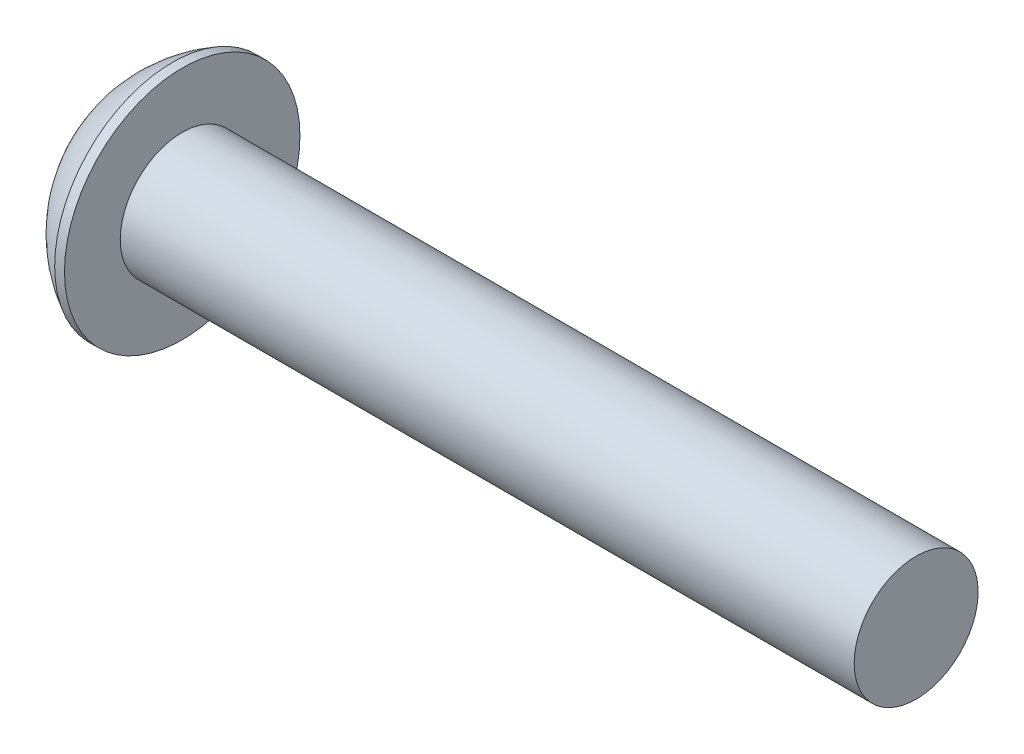
ISO-10303-21;
HEADER;
FILE_DESCRIPTION(('STEP AP214'),'2;1');
FILE_NAME('part.step','',(''),(''),'','','');
FILE_SCHEMA(('AUTOMOTIVE_DESIGN { 1 0 10303 214 1 1 1 1 }'));
ENDSEC;
DATA;
#1=APPLICATION_CONTEXT('core data for automotive mechanical design processes');
#2=APPLICATION_PROTOCOL_DEFINITION('international standard','automotive_design',2000,#1);
#3=PRODUCT_CONTEXT('',#1,'mechanical');
#4=PRODUCT('Part','Part','',(#3));
#5=PRODUCT_RELATED_PRODUCT_CATEGORY('part','',(#4));
#6=PRODUCT_DEFINITION_FORMATION('','',#4);
#7=PRODUCT_DEFINITION_CONTEXT('part definition',#1,'design');
#8=PRODUCT_DEFINITION('design','',#6,#7);
#9=PRODUCT_DEFINITION_SHAPE('','',#8);
#10=(LENGTH_UNIT() NAMED_UNIT(*) SI_UNIT(.MILLI.,.METRE.));
#11=(NAMED_UNIT(*) PLANE_ANGLE_UNIT() SI_UNIT($,.RADIAN.));
#12=(NAMED_UNIT(*) SI_UNIT($,.STERADIAN.) SOLID_ANGLE_UNIT());
#13=UNCERTAINTY_MEASURE_WITH_UNIT(LENGTH_MEASURE(1.E-05),#10,'distance_accuracy_value','');
#14=(GEOMETRIC_REPRESENTATION_CONTEXT(3) GLOBAL_UNCERTAINTY_ASSIGNED_CONTEXT((#13)) GLOBAL_UNIT_ASSIGNED_CONTEXT((#10,
#11,#12)) REPRESENTATION_CONTEXT('',''));
#15=CARTESIAN_POINT('',(0.,0.,0.));
#16=DIRECTION('',(0.,0.,1.));
#17=DIRECTION('',(1.,0.,0.));
#18=AXIS2_PLACEMENT_3D('',#15,#16,#17);
#19=CARTESIAN_POINT('',(-1.82880000000001,0.,0.));
#20=DIRECTION('',(-1.,0.,0.));
#21=DIRECTION('',(0.,0.,1.));
#22=AXIS2_PLACEMENT_3D('',#19,#20,#21);
#23=CONICAL_SURFACE('',#22,1.8288,0.785398163397446);
#24=CARTESIAN_POINT('',(-1.82880000000001,0.,0.));
#25=DIRECTION('',(-1.,0.,0.));
#26=DIRECTION('',(0.,0.,1.));
#27=AXIS2_PLACEMENT_3D('',#24,#25,#26);
#28=CIRCLE('',#27,1.8288);
#29=CARTESIAN_POINT('',(-1.82880000000001,-1.58004822109681,0.920845838894231));
#30=VERTEX_POINT('',#29);
#31=CARTESIAN_POINT('',(-1.82880000000001,-0.00745177890319401,1.82878481812136));
#32=VERTEX_POINT('',#31);
#33=EDGE_CURVE('E240',#30,#32,#28,.T.);
#34=ORIENTED_EDGE('',*,*,#33,.T.);
#35=CARTESIAN_POINT('',(-1.82900000000001,-0.00710296193273345,1.82898620769315));
#36=CARTESIAN_POINT('',(-1.79798176582111,-0.0612413968680546,1.79772936770974));
#37=CARTESIAN_POINT('',(-1.768804762154,-0.116280715119972,1.76595240250098));
#38=CARTESIAN_POINT('',(-1.71541731135211,-0.228486753173012,1.70117021622636));
#39=CARTESIAN_POINT('',(-1.6912359800132,-0.285663770827649,1.66815904969199));
#40=CARTESIAN_POINT('',(-1.64983313923053,-0.400953626097388,1.60159642071718));
#41=CARTESIAN_POINT('',(-1.63250927558265,-0.459038096623036,1.56806133602346));
#42=CARTESIAN_POINT('',(-1.60583796244815,-0.576464657697729,1.50026507937697));
#43=CARTESIAN_POINT('',(-1.59647107247955,-0.635803317985221,1.46600588788664));
#44=CARTESIAN_POINT('',(-1.58800887531627,-0.738427717920976,1.4067556629583));
#45=CARTESIAN_POINT('',(-1.58678086812113,-0.781586520417755,1.38183791671889));
#46=CARTESIAN_POINT('',(-1.58902398395721,-0.867829492194639,1.33204551374779));
#47=CARTESIAN_POINT('',(-1.59249673611106,-0.91091363041643,1.30717087494764));
#48=CARTESIAN_POINT('',(-1.60394206540771,-0.996659819496216,1.25766528960044));
#49=CARTESIAN_POINT('',(-1.61191838302761,-1.0393214894606,1.23303456296242));
#50=CARTESIAN_POINT('',(-1.63193840774461,-1.12392707655171,1.18418750448042));
#51=CARTESIAN_POINT('',(-1.6439838418413,-1.1658706809649,1.15997135318168));
#52=CARTESIAN_POINT('',(-1.67924043571692,-1.27185330769289,1.09878225511086));
#53=CARTESIAN_POINT('',(-1.70494165955475,-1.33527334252756,1.06216668092704));
#54=CARTESIAN_POINT('',(-1.74825503670668,-1.4285641683064,1.00830519755071));
#55=CARTESIAN_POINT('',(-1.76346130507454,-1.45931193774139,0.990552964590433));
#56=CARTESIAN_POINT('',(-1.79524996181871,-1.52025510962339,0.955367407899094));
#57=CARTESIAN_POINT('',(-1.8118317729839,-1.55045073733563,0.937933954111083));
#58=CARTESIAN_POINT('',(-1.82900000000027,-1.58039703806773,0.920644449322171));
#59=B_SPLINE_CURVE_WITH_KNOTS('',3,(#35,#36,#37,#38,#39,#40,#41,#42,#43,#44,#45,#46,#47,#48,#49,
#50,#51,#52,#53,#54,#55,#56,#57,#58),.UNSPECIFIED.,.F.,.F.,(4,2,2,2,2,2,2,2,2,2,2,4),(0.,
0.209500144466995,0.420188843332821,0.627602144749848,0.834507224341982,0.983847288144541,
1.13323912136536,1.28275521623455,1.43233484807212,1.66469982490852,1.78055165650198,
1.89635511741463),.UNSPECIFIED.);
#60=EDGE_CURVE('E210',#32,#30,#59,.T.);
#61=ORIENTED_EDGE('',*,*,#60,.T.);
#62=EDGE_LOOP('',(#34,#61));
#63=FACE_BOUND('',#62,.T.);
#64=ADVANCED_FACE('F37',(#63),#23,.F.);
#65=CARTESIAN_POINT('',(-1.82880000000001,-1.5875,-0.907938979227128));
#66=VERTEX_POINT('',#65);
#67=CARTESIAN_POINT('',(-1.82880000000001,-1.5875,0.907938979227128));
#68=VERTEX_POINT('',#67);
#69=EDGE_CURVE('E271',#66,#68,#28,.T.);
#70=ORIENTED_EDGE('',*,*,#69,.T.);
#71=CARTESIAN_POINT('',(-2.41884583359235,-1.5875,-1.82500929221936));
#72=CARTESIAN_POINT('',(-2.38531276542623,-1.5875,-1.78055818469936));
#73=CARTESIAN_POINT('',(-2.35210936835997,-1.5875,-1.73585907650942));
#74=CARTESIAN_POINT('',(-2.28649794756445,-1.5875,-1.64586427633954));
#75=CARTESIAN_POINT('',(-2.25409012601858,-1.5875,-1.600568437113));
#76=CARTESIAN_POINT('',(-2.15780190494498,-1.5875,-1.46297210215584));
#77=CARTESIAN_POINT('',(-2.09537319757193,-1.5875,-1.36963858857972));
#78=CARTESIAN_POINT('',(-1.97284516161749,-1.5875,-1.1739408617932));
#79=CARTESIAN_POINT('',(-1.91308014332863,-1.5875,-1.07136492019386));
#80=CARTESIAN_POINT('',(-1.80377603992626,-1.5875,-0.861093370178888));
#81=CARTESIAN_POINT('',(-1.75420248563308,-1.5875,-0.753416586787839));
#82=CARTESIAN_POINT('',(-1.69355473541147,-1.5875,-0.59176442890705));
#83=CARTESIAN_POINT('',(-1.67614346878425,-1.5875,-0.540176081947481));
#84=CARTESIAN_POINT('',(-1.64546298974417,-1.5875,-0.435756532214797));
#85=CARTESIAN_POINT('',(-1.63219406350996,-1.5875,-0.382925243842576));
#86=CARTESIAN_POINT('',(-1.61070764570342,-1.5875,-0.277216790300937));
#87=CARTESIAN_POINT('',(-1.60240378593419,-1.5875,-0.224357458354004));
#88=CARTESIAN_POINT('',(-1.59100915058537,-1.5875,-0.118076745851791));
#89=CARTESIAN_POINT('',(-1.58791748493136,-1.5875,-0.0646554628277626));
#90=CARTESIAN_POINT('',(-1.58717534074502,-1.5875,0.0403024254508756));
#91=CARTESIAN_POINT('',(-1.58933324549264,-1.5875,0.091837742427017));
#92=CARTESIAN_POINT('',(-1.59854919060368,-1.5875,0.194465290551352));
#93=CARTESIAN_POINT('',(-1.60560770796995,-1.5875,0.245557478077194));
#94=CARTESIAN_POINT('',(-1.62435975757509,-1.5875,0.347793759019247));
#95=CARTESIAN_POINT('',(-1.63613206364932,-1.5875,0.398923183857681));
#96=CARTESIAN_POINT('',(-1.66368690090293,-1.5875,0.500065247928145));
#97=CARTESIAN_POINT('',(-1.67946909288466,-1.5875,0.55007798123241));
#98=CARTESIAN_POINT('',(-1.73513369416259,-1.5875,0.707672888264433));
#99=CARTESIAN_POINT('',(-1.78136125535134,-1.5875,0.813008430509164));
#100=CARTESIAN_POINT('',(-1.88413869504212,-1.5875,1.01872985181378));
#101=CARTESIAN_POINT('',(-1.94072568595621,-1.5875,1.11909623158762));
#102=CARTESIAN_POINT('',(-2.05746539148359,-1.5875,1.31090882483437));
#103=CARTESIAN_POINT('',(-2.11730100937777,-1.5875,1.40255044446812));
#104=CARTESIAN_POINT('',(-2.20979890181475,-1.5875,1.53756602680818));
#105=CARTESIAN_POINT('',(-2.24095734379018,-1.5875,1.58198845986807));
#106=CARTESIAN_POINT('',(-2.30409778175578,-1.5875,1.67022633905771));
#107=CARTESIAN_POINT('',(-2.33607954894282,-1.5875,1.71404194872823));
#108=CARTESIAN_POINT('',(-2.36840270150048,-1.5875,1.75760493469799));
#109=B_SPLINE_CURVE_WITH_KNOTS('',3,(#71,#72,#73,#74,#75,#76,#77,#78,#79,#80,#81,#82,#83,#84,
#85,#86,#87,#88,#89,#90,#91,#92,#93,#94,#95,#96,#97,#98,#99,#100,#101,#102,#103,#104,#105,#106,
#107,#108),.UNSPECIFIED.,.F.,.F.,(4,2,2,2,2,2,2,2,2,2,2,2,2,2,2,2,2,2,4),(0.,0.167038582206584,
0.33411918424497,0.670830460170841,1.0266880706705,1.38132155981881,1.54452529826255,
1.70774030934245,1.86802667313751,2.02828566242478,2.18278328824718,2.33729595425851,
2.49450635071892,2.65170345312208,2.99578906555957,3.34113237629954,3.66930816833921,
3.83208342752259,3.99481392942941),.UNSPECIFIED.);
#110=EDGE_CURVE('E219',#68,#66,#109,.F.);
#111=ORIENTED_EDGE('',*,*,#110,.T.);
#112=EDGE_LOOP('',(#70,#111));
#113=FACE_BOUND('',#112,.T.);
#114=ADVANCED_FACE('F291',(#113),#23,.F.);
#115=CARTESIAN_POINT('',(-1.82880000000001,-0.00745177890319544,-1.82878481812136));
#116=VERTEX_POINT('',#115);
#117=CARTESIAN_POINT('',(-1.82880000000001,-1.5800482210968,-0.920845838894231));
#118=VERTEX_POINT('',#117);
#119=EDGE_CURVE('E263',#116,#118,#28,.T.);
#120=ORIENTED_EDGE('',*,*,#119,.T.);
#121=CARTESIAN_POINT('',(-1.82900000000027,-1.58039703806773,-0.92064444932217));
#122=CARTESIAN_POINT('',(-1.79798176582135,-1.52625860313238,-0.951901289305598));
#123=CARTESIAN_POINT('',(-1.76880476215421,-1.47121928488044,-0.983678254514372));
#124=CARTESIAN_POINT('',(-1.71541731135227,-1.35901324682734,-1.04846044078903));
#125=CARTESIAN_POINT('',(-1.69123598001333,-1.30183622917267,-1.08147160732341));
#126=CARTESIAN_POINT('',(-1.64983313923061,-1.18654637390287,-1.14803423629826));
#127=CARTESIAN_POINT('',(-1.63250927558271,-1.12846190337719,-1.181569320992));
#128=CARTESIAN_POINT('',(-1.60583796244818,-1.01103534230243,-1.24936557763853));
#129=CARTESIAN_POINT('',(-1.59647107247956,-0.951696682014903,-1.28362476912888));
#130=CARTESIAN_POINT('',(-1.58800887531627,-0.849072282079112,-1.34287499405724));
#131=CARTESIAN_POINT('',(-1.58678086812113,-0.805913479582333,-1.36779274029665));
#132=CARTESIAN_POINT('',(-1.58902398395721,-0.719670507805445,-1.41758514326775));
#133=CARTESIAN_POINT('',(-1.59249673611105,-0.676586369583652,-1.44245978206791));
#134=CARTESIAN_POINT('',(-1.6039420654077,-0.590840180503863,-1.49196536741511));
#135=CARTESIAN_POINT('',(-1.6119183830276,-0.548178510539482,-1.51659609405312));
#136=CARTESIAN_POINT('',(-1.63193840774459,-0.463572923448364,-1.56544315253513));
#137=CARTESIAN_POINT('',(-1.64398384184128,-0.42162931903517,-1.58965930383387));
#138=CARTESIAN_POINT('',(-1.67924043571687,-0.315646692307252,-1.65084840190465));
#139=CARTESIAN_POINT('',(-1.70494165955467,-0.252226657472646,-1.68746397608843));
#140=CARTESIAN_POINT('',(-1.74825503670654,-0.158935831693912,-1.7413254594647));
#141=CARTESIAN_POINT('',(-1.76346130507437,-0.128188062258946,-1.75907769242496));
#142=CARTESIAN_POINT('',(-1.79524996181849,-0.0672448903770135,-1.79426324911627));
#143=CARTESIAN_POINT('',(-1.81183177298366,-0.0370492626648058,-1.81169670290426));
#144=CARTESIAN_POINT('',(-1.82900000000001,-0.00710296193273376,-1.82898620769315));
#145=B_SPLINE_CURVE_WITH_KNOTS('',3,(#121,#122,#123,#124,#125,#126,#127,#128,#129,#130,#131,
#132,#133,#134,#135,#136,#137,#138,#139,#140,#141,#142,#143,#144),.UNSPECIFIED.,.F.,.F.,(4,2,2,
2,2,2,2,2,2,2,2,4),(0.,0.209500144467117,0.420188843333067,0.627602144750218,0.834507224342474,
0.983847288145038,1.13323912136587,1.28275521623506,1.43233484807263,1.66469982490878,
1.78055165650211,1.89635511741463),.UNSPECIFIED.);
#146=EDGE_CURVE('E269',#118,#116,#145,.T.);
#147=ORIENTED_EDGE('',*,*,#146,.T.);
#148=EDGE_LOOP('',(#120,#147));
#149=FACE_BOUND('',#148,.T.);
#150=ADVANCED_FACE('F268',(#149),#23,.F.);
#151=CARTESIAN_POINT('',(-1.82880000000001,1.5800482210968,-0.920845838894232));
#152=VERTEX_POINT('',#151);
#153=CARTESIAN_POINT('',(-1.82880000000001,0.00745177890319596,-1.82878481812136));
#154=VERTEX_POINT('',#153);
#155=EDGE_CURVE('E270',#152,#154,#28,.T.);
#156=ORIENTED_EDGE('',*,*,#155,.T.);
#157=CARTESIAN_POINT('',(-1.82900000000001,0.00710296193273401,-1.82898620769315));
#158=CARTESIAN_POINT('',(-1.79798176582111,0.0612413968680552,-1.79772936770974));
#159=CARTESIAN_POINT('',(-1.768804762154,0.116280715119972,-1.76595240250098));
#160=CARTESIAN_POINT('',(-1.71541731135211,0.228486753173013,-1.70117021622636));
#161=CARTESIAN_POINT('',(-1.6912359800132,0.28566377082765,-1.66815904969199));
#162=CARTESIAN_POINT('',(-1.64983313923053,0.40095362609739,-1.60159642071718));
#163=CARTESIAN_POINT('',(-1.63250927558265,0.459038096623037,-1.56806133602346));
#164=CARTESIAN_POINT('',(-1.60583796244815,0.57646465769773,-1.50026507937697));
#165=CARTESIAN_POINT('',(-1.59647107247955,0.635803317985223,-1.46600588788664));
#166=CARTESIAN_POINT('',(-1.58800887531627,0.738427717920978,-1.4067556629583));
#167=CARTESIAN_POINT('',(-1.58678086812113,0.781586520417756,-1.38183791671889));
#168=CARTESIAN_POINT('',(-1.58902398395721,0.86782949219464,-1.33204551374779));
#169=CARTESIAN_POINT('',(-1.59249673611106,0.910913630416431,-1.30717087494764));
#170=CARTESIAN_POINT('',(-1.60394206540771,0.996659819496218,-1.25766528960044));
#171=CARTESIAN_POINT('',(-1.61191838302761,1.0393214894606,-1.23303456296242));
#172=CARTESIAN_POINT('',(-1.63193840774461,1.12392707655171,-1.18418750448042));
#173=CARTESIAN_POINT('',(-1.6439838418413,1.1658706809649,-1.15997135318168));
#174=CARTESIAN_POINT('',(-1.67924043571692,1.27185330769289,-1.09878225511085));
#175=CARTESIAN_POINT('',(-1.70494165955476,1.33527334252757,-1.06216668092704));
#176=CARTESIAN_POINT('',(-1.74825503670668,1.4285641683064,-1.00830519755071));
#177=CARTESIAN_POINT('',(-1.76346130507454,1.45931193774139,-0.990552964590433));
#178=CARTESIAN_POINT('',(-1.79524996181871,1.52025510962339,-0.955367407899094));
#179=CARTESIAN_POINT('',(-1.8118317729839,1.55045073733563,-0.937933954111083));
#180=CARTESIAN_POINT('',(-1.82900000000027,1.58039703806773,-0.920644449322171));
#181=B_SPLINE_CURVE_WITH_KNOTS('',3,(#157,#158,#159,#160,#161,#162,#163,#164,#165,#166,#167,
#168,#169,#170,#171,#172,#173,#174,#175,#176,#177,#178,#179,#180),.UNSPECIFIED.,.F.,.F.,(4,2,2,
2,2,2,2,2,2,2,2,4),(0.,0.209500144466995,0.420188843332822,0.627602144749849,0.834507224341983,
0.983847288144542,1.13323912136536,1.28275521623455,1.43233484807213,1.66469982490853,
1.78055165650198,1.89635511741463),.UNSPECIFIED.);
#182=EDGE_CURVE('E306',#154,#152,#181,.T.);
#183=ORIENTED_EDGE('',*,*,#182,.T.);
#184=EDGE_LOOP('',(#156,#183));
#185=FACE_BOUND('',#184,.T.);
#186=ADVANCED_FACE('F288',(#185),#23,.F.);
#187=CARTESIAN_POINT('',(-1.82880000000001,1.5875,0.907938979227128));
#188=VERTEX_POINT('',#187);
#189=CARTESIAN_POINT('',(-1.82880000000001,1.5875,-0.907938979227127));
#190=VERTEX_POINT('',#189);
#191=EDGE_CURVE('E244',#188,#190,#28,.T.);
#192=ORIENTED_EDGE('',*,*,#191,.T.);
#193=CARTESIAN_POINT('',(-2.41884583359235,1.5875,-1.82500929221937));
#194=CARTESIAN_POINT('',(-2.38531276542623,1.5875,-1.78055818469936));
#195=CARTESIAN_POINT('',(-2.35210936835997,1.5875,-1.73585907650943));
#196=CARTESIAN_POINT('',(-2.28649794756445,1.5875,-1.64586427633954));
#197=CARTESIAN_POINT('',(-2.25409012601858,1.5875,-1.600568437113));
#198=CARTESIAN_POINT('',(-2.15780190494498,1.5875,-1.46297210215584));
#199=CARTESIAN_POINT('',(-2.09537319757193,1.5875,-1.36963858857972));
#200=CARTESIAN_POINT('',(-1.97284516161749,1.5875,-1.1739408617932));
#201=CARTESIAN_POINT('',(-1.91308014332863,1.5875,-1.07136492019386));
#202=CARTESIAN_POINT('',(-1.80377603992627,1.5875,-0.86109337017889));
#203=CARTESIAN_POINT('',(-1.75420248563308,1.5875,-0.75341658678784));
#204=CARTESIAN_POINT('',(-1.69355473541147,1.5875,-0.591764428907051));
#205=CARTESIAN_POINT('',(-1.67614346878425,1.5875,-0.540176081947481));
#206=CARTESIAN_POINT('',(-1.64546298974417,1.5875,-0.435756532214797));
#207=CARTESIAN_POINT('',(-1.63219406350996,1.5875,-0.382925243842576));
#208=CARTESIAN_POINT('',(-1.61070764570342,1.5875,-0.277216790300937));
#209=CARTESIAN_POINT('',(-1.60240378593419,1.5875,-0.224357458354004));
#210=CARTESIAN_POINT('',(-1.59100915058537,1.5875,-0.118076745851792));
#211=CARTESIAN_POINT('',(-1.58791748493136,1.5875,-0.0646554628277632));
#212=CARTESIAN_POINT('',(-1.58717534074502,1.5875,0.0403024254508752));
#213=CARTESIAN_POINT('',(-1.58933324549264,1.5875,0.0918377424270167));
#214=CARTESIAN_POINT('',(-1.59854919060368,1.5875,0.194465290551352));
#215=CARTESIAN_POINT('',(-1.60560770796995,1.5875,0.245557478077193));
#216=CARTESIAN_POINT('',(-1.62435975757509,1.5875,0.347793759019247));
#217=CARTESIAN_POINT('',(-1.63613206364932,1.5875,0.39892318385768));
#218=CARTESIAN_POINT('',(-1.66368690090293,1.5875,0.500065247928144));
#219=CARTESIAN_POINT('',(-1.67946909288466,1.5875,0.55007798123241));
#220=CARTESIAN_POINT('',(-1.73513369416259,1.5875,0.707672888264433));
#221=CARTESIAN_POINT('',(-1.78136125535134,1.5875,0.813008430509163));
#222=CARTESIAN_POINT('',(-1.88413869504212,1.5875,1.01872985181378));
#223=CARTESIAN_POINT('',(-1.94072568595621,1.5875,1.11909623158762));
#224=CARTESIAN_POINT('',(-2.05746539148359,1.5875,1.31090882483437));
#225=CARTESIAN_POINT('',(-2.11730100937777,1.5875,1.40255044446812));
#226=CARTESIAN_POINT('',(-2.20979890181475,1.5875,1.53756602680818));
#227=CARTESIAN_POINT('',(-2.24095734379018,1.5875,1.58198845986807));
#228=CARTESIAN_POINT('',(-2.30409778175578,1.5875,1.67022633905771));
#229=CARTESIAN_POINT('',(-2.33607954894282,1.5875,1.71404194872823));
#230=CARTESIAN_POINT('',(-2.36840270150048,1.5875,1.75760493469799));
#231=B_SPLINE_CURVE_WITH_KNOTS('',3,(#193,#194,#195,#196,#197,#198,#199,#200,#201,#202,#203,
#204,#205,#206,#207,#208,#209,#210,#211,#212,#213,#214,#215,#216,#217,#218,#219,#220,#221,#222,
#223,#224,#225,#226,#227,#228,#229,#230),.UNSPECIFIED.,.F.,.F.,(4,2,2,2,2,2,2,2,2,2,2,2,2,2,2,2,
2,2,4),(0.,0.167038582206583,0.334119184244971,0.670830460170842,1.0266880706705,
1.38132155981881,1.54452529826255,1.70774030934245,1.86802667313751,2.02828566242479,
2.18278328824719,2.33729595425851,2.49450635071892,2.65170345312209,2.99578906555957,
3.34113237629954,3.66930816833921,3.83208342752259,3.99481392942941),.UNSPECIFIED.);
#232=EDGE_CURVE('E190',#190,#188,#231,.T.);
#233=ORIENTED_EDGE('',*,*,#232,.T.);
#234=EDGE_LOOP('',(#192,#233));
#235=FACE_BOUND('',#234,.T.);
#236=ADVANCED_FACE('F282',(#235),#23,.F.);
#237=CARTESIAN_POINT('',(-1.82880000000001,0.00745177890319537,1.82878481812136));
#238=VERTEX_POINT('',#237);
#239=CARTESIAN_POINT('',(-1.82880000000001,1.58004822109681,0.920845838894231));
#240=VERTEX_POINT('',#239);
#241=EDGE_CURVE('E241',#238,#240,#28,.T.);
#242=ORIENTED_EDGE('',*,*,#241,.T.);
#243=CARTESIAN_POINT('',(-1.82900000000027,1.58039703806773,0.92064444932217));
#244=CARTESIAN_POINT('',(-1.79798176582135,1.52625860313238,0.951901289305598));
#245=CARTESIAN_POINT('',(-1.76880476215421,1.47121928488044,0.983678254514371));
#246=CARTESIAN_POINT('',(-1.71541731135227,1.35901324682734,1.04846044078903));
#247=CARTESIAN_POINT('',(-1.69123598001333,1.30183622917267,1.08147160732341));
#248=CARTESIAN_POINT('',(-1.64983313923061,1.18654637390287,1.14803423629826));
#249=CARTESIAN_POINT('',(-1.63250927558271,1.12846190337719,1.181569320992));
#250=CARTESIAN_POINT('',(-1.60583796244818,1.01103534230243,1.24936557763853));
#251=CARTESIAN_POINT('',(-1.59647107247956,0.951696682014904,1.28362476912888));
#252=CARTESIAN_POINT('',(-1.58800887531627,0.849072282079113,1.34287499405724));
#253=CARTESIAN_POINT('',(-1.58678086812113,0.805913479582333,1.36779274029665));
#254=CARTESIAN_POINT('',(-1.58902398395721,0.719670507805446,1.41758514326775));
#255=CARTESIAN_POINT('',(-1.59249673611105,0.676586369583653,1.44245978206791));
#256=CARTESIAN_POINT('',(-1.6039420654077,0.590840180503864,1.49196536741511));
#257=CARTESIAN_POINT('',(-1.6119183830276,0.548178510539483,1.51659609405312));
#258=CARTESIAN_POINT('',(-1.63193840774459,0.463572923448365,1.56544315253513));
#259=CARTESIAN_POINT('',(-1.64398384184128,0.421629319035171,1.58965930383387));
#260=CARTESIAN_POINT('',(-1.67924043571687,0.315646692307252,1.65084840190465));
#261=CARTESIAN_POINT('',(-1.70494165955467,0.252226657472647,1.68746397608843));
#262=CARTESIAN_POINT('',(-1.74825503670654,0.158935831693913,1.7413254594647));
#263=CARTESIAN_POINT('',(-1.76346130507437,0.128188062258947,1.75907769242496));
#264=CARTESIAN_POINT('',(-1.79524996181849,0.0672448903770139,1.79426324911627));
#265=CARTESIAN_POINT('',(-1.81183177298366,0.0370492626648061,1.81169670290426));
#266=CARTESIAN_POINT('',(-1.82900000000001,0.00710296193273415,1.82898620769315));
#267=B_SPLINE_CURVE_WITH_KNOTS('',3,(#243,#244,#245,#246,#247,#248,#249,#250,#251,#252,#253,
#254,#255,#256,#257,#258,#259,#260,#261,#262,#263,#264,#265,#266),.UNSPECIFIED.,.F.,.F.,(4,2,2,
2,2,2,2,2,2,2,2,4),(0.,0.209500144467116,0.420188843333066,0.627602144750218,0.834507224342473,
0.983847288145037,1.13323912136587,1.28275521623506,1.43233484807263,1.66469982490878,
1.78055165650211,1.89635511741463),.UNSPECIFIED.);
#268=EDGE_CURVE('E172',#240,#238,#267,.T.);
#269=ORIENTED_EDGE('',*,*,#268,.T.);
#270=EDGE_LOOP('',(#242,#269));
#271=FACE_BOUND('',#270,.T.);
#272=ADVANCED_FACE('F39',(#271),#23,.F.);
#273=CARTESIAN_POINT('',(-1.82880000000001,2.413,0.));
#274=DIRECTION('',(1.,0.,0.));
#275=DIRECTION('',(0.,0.,-1.));
#276=AXIS2_PLACEMENT_3D('',#273,#274,#275);
#277=PLANE('',#276);
#278=ORIENTED_EDGE('',*,*,#33,.F.);
#279=DIRECTION('',(0.,0.866025403784439,0.5));
#280=VECTOR('',#279,1.);
#281=CARTESIAN_POINT('',(-1.82880000000001,-1.5875,0.91654355233853));
#282=LINE('',#281,#280);
#283=CARTESIAN_POINT('',(-1.82880000000001,-1.5875,0.91654355233853));
#284=VERTEX_POINT('',#283);
#285=EDGE_CURVE('E161',#284,#30,#282,.T.);
#286=ORIENTED_EDGE('',*,*,#285,.F.);
#287=DIRECTION('',(0.,0.,-1.));
#288=VECTOR('',#287,1.);
#289=CARTESIAN_POINT('',(-1.82880000000001,-1.5875,0.));
#290=LINE('',#289,#288);
#291=EDGE_CURVE('E11',#284,#68,#290,.T.);
#292=ORIENTED_EDGE('',*,*,#291,.T.);
#293=ORIENTED_EDGE('',*,*,#69,.F.);
#294=DIRECTION('',(0.,0.,1.));
#295=VECTOR('',#294,1.);
#296=CARTESIAN_POINT('',(-1.82880000000001,-1.5875,-0.91654355233853));
#297=LINE('',#296,#295);
#298=CARTESIAN_POINT('',(-1.82880000000001,-1.5875,-0.91654355233853));
#299=VERTEX_POINT('',#298);
#300=EDGE_CURVE('E149',#299,#66,#297,.T.);
#301=ORIENTED_EDGE('',*,*,#300,.F.);
#302=DIRECTION('',(0.,0.866025403784439,-0.5));
#303=VECTOR('',#302,1.);
#304=CARTESIAN_POINT('',(-1.82880000000001,1.016,-2.41967497817372));
#305=LINE('',#304,#303);
#306=EDGE_CURVE('E46',#299,#118,#305,.T.);
#307=ORIENTED_EDGE('',*,*,#306,.T.);
#308=ORIENTED_EDGE('',*,*,#119,.F.);
#309=DIRECTION('',(0.,-0.866025403784438,0.5));
#310=VECTOR('',#309,1.);
#311=CARTESIAN_POINT('',(-1.82880000000001,0.,-1.83308710467706));
#312=LINE('',#311,#310);
#313=CARTESIAN_POINT('',(-1.82880000000001,0.,-1.83308710467706));
#314=VERTEX_POINT('',#313);
#315=EDGE_CURVE('E151',#314,#116,#312,.T.);
#316=ORIENTED_EDGE('',*,*,#315,.F.);
#317=DIRECTION('',(0.,0.866025403784439,0.5));
#318=VECTOR('',#317,1.);
#319=CARTESIAN_POINT('',(-1.82880000000001,2.6035,-0.329955678841872));
#320=LINE('',#319,#318);
#321=EDGE_CURVE('E252',#314,#154,#320,.T.);
#322=ORIENTED_EDGE('',*,*,#321,.T.);
#323=ORIENTED_EDGE('',*,*,#155,.F.);
#324=DIRECTION('',(0.,-0.866025403784438,-0.5));
#325=VECTOR('',#324,1.);
#326=CARTESIAN_POINT('',(-1.82880000000001,1.5875,-0.91654355233853));
#327=LINE('',#326,#325);
#328=CARTESIAN_POINT('',(-1.82880000000001,1.5875,-0.91654355233853));
#329=VERTEX_POINT('',#328);
#330=EDGE_CURVE('E167',#329,#152,#327,.T.);
#331=ORIENTED_EDGE('',*,*,#330,.F.);
#332=DIRECTION('',(0.,0.,1.));
#333=VECTOR('',#332,1.);
#334=CARTESIAN_POINT('',(-1.82880000000001,1.5875,0.));
#335=LINE('',#334,#333);
#336=EDGE_CURVE('E248',#329,#190,#335,.T.);
#337=ORIENTED_EDGE('',*,*,#336,.T.);
#338=ORIENTED_EDGE('',*,*,#191,.F.);
#339=DIRECTION('',(0.,0.,-1.));
#340=VECTOR('',#339,1.);
#341=CARTESIAN_POINT('',(-1.82880000000001,1.5875,0.91654355233853));
#342=LINE('',#341,#340);
#343=CARTESIAN_POINT('',(-1.82880000000001,1.5875,0.91654355233853));
#344=VERTEX_POINT('',#343);
#345=EDGE_CURVE('E165',#344,#188,#342,.T.);
#346=ORIENTED_EDGE('',*,*,#345,.F.);
#347=DIRECTION('',(0.,-0.866025403784438,0.5));
#348=VECTOR('',#347,1.);
#349=CARTESIAN_POINT('',(-1.82880000000001,2.6035,0.329955678841871));
#350=LINE('',#349,#348);
#351=EDGE_CURVE('E245',#344,#240,#350,.T.);
#352=ORIENTED_EDGE('',*,*,#351,.T.);
#353=ORIENTED_EDGE('',*,*,#241,.F.);
#354=DIRECTION('',(0.,0.866025403784438,-0.5));
#355=VECTOR('',#354,1.);
#356=CARTESIAN_POINT('',(-1.82880000000001,0.,1.83308710467706));
#357=LINE('',#356,#355);
#358=CARTESIAN_POINT('',(-1.82880000000001,0.,1.83308710467706));
#359=VERTEX_POINT('',#358);
#360=EDGE_CURVE('E163',#359,#238,#357,.T.);
#361=ORIENTED_EDGE('',*,*,#360,.F.);
#362=DIRECTION('',(0.,-0.866025403784439,-0.5));
#363=VECTOR('',#362,1.);
#364=CARTESIAN_POINT('',(-1.82880000000001,1.016,2.41967497817372));
#365=LINE('',#364,#363);
#366=EDGE_CURVE('E132',#359,#32,#365,.T.);
#367=ORIENTED_EDGE('',*,*,#366,.T.);
#368=EDGE_LOOP('',(#278,#286,#292,#293,#301,#307,#308,#316,#322,#323,#331,#337,#338,#346,#352,
#353,#361,#367));
#369=FACE_BOUND('',#368,.T.);
#370=CARTESIAN_POINT('',(-1.82880000000001,0.,0.));
#371=DIRECTION('',(-1.,0.,0.));
#372=DIRECTION('',(0.,0.,1.));
#373=AXIS2_PLACEMENT_3D('',#370,#371,#372);
#374=CIRCLE('',#373,2.413);
#375=CARTESIAN_POINT('',(-1.82880000000001,0.,2.413));
#376=VERTEX_POINT('',#375);
#377=EDGE_CURVE('E237',#376,#376,#374,.T.);
#378=ORIENTED_EDGE('',*,*,#377,.T.);
#379=EDGE_LOOP('',(#378));
#380=FACE_BOUND('',#379,.T.);
#381=ADVANCED_FACE('F260',(#369,#380),#277,.F.);
#382=CARTESIAN_POINT('',(2.75154317616325,0.,0.));
#383=DIRECTION('',(-1.,0.,0.));
#384=DIRECTION('',(0.,0.,1.));
#385=AXIS2_PLACEMENT_3D('',#382,#383,#384);
#386=DEGENERATE_TOROIDAL_SURFACE('',#385,0.00969167426947842,5.1816,.F.);
#387=ORIENTED_EDGE('',*,*,#377,.F.);
#388=EDGE_LOOP('',(#387));
#389=FACE_BOUND('',#388,.T.);
#390=CARTESIAN_POINT('',(0.355599999999993,0.,0.));
#391=DIRECTION('',(-1.,0.,0.));
#392=DIRECTION('',(0.,0.,1.));
#393=AXIS2_PLACEMENT_3D('',#390,#391,#392);
#394=CIRCLE('',#393,4.5847);
#395=CARTESIAN_POINT('',(0.355599999999993,0.,4.5847));
#396=VERTEX_POINT('',#395);
#397=EDGE_CURVE('E234',#396,#396,#394,.T.);
#398=ORIENTED_EDGE('',*,*,#397,.T.);
#399=EDGE_LOOP('',(#398));
#400=FACE_BOUND('',#399,.T.);
#401=ADVANCED_FACE('F287',(#389,#400),#386,.F.);
#402=CARTESIAN_POINT('',(0.,0.,0.));
#403=DIRECTION('',(-1.,0.,0.));
#404=DIRECTION('',(0.,0.,1.));
#405=AXIS2_PLACEMENT_3D('',#402,#403,#404);
#406=CYLINDRICAL_SURFACE('',#405,4.5847);
#407=ORIENTED_EDGE('',*,*,#397,.F.);
#408=EDGE_LOOP('',(#407));
#409=FACE_BOUND('',#408,.T.);
#410=CARTESIAN_POINT('',(0.736599999999993,0.,0.));
#411=DIRECTION('',(-1.,0.,0.));
#412=DIRECTION('',(0.,0.,1.));
#413=AXIS2_PLACEMENT_3D('',#410,#411,#412);
#414=CIRCLE('',#413,4.5847);
#415=CARTESIAN_POINT('',(0.736599999999993,0.,4.5847));
#416=VERTEX_POINT('',#415);
#417=EDGE_CURVE('E231',#416,#416,#414,.T.);
#418=ORIENTED_EDGE('',*,*,#417,.T.);
#419=EDGE_LOOP('',(#418));
#420=FACE_BOUND('',#419,.T.);
#421=ADVANCED_FACE('F385',(#409,#420),#406,.T.);
#422=CARTESIAN_POINT('',(0.736599999999993,2.413,0.));
#423=DIRECTION('',(-1.,0.,0.));
#424=DIRECTION('',(0.,0.,1.));
#425=AXIS2_PLACEMENT_3D('',#422,#423,#424);
#426=PLANE('',#425);
#427=ORIENTED_EDGE('',*,*,#417,.F.);
#428=EDGE_LOOP('',(#427));
#429=FACE_BOUND('',#428,.T.);
#430=CARTESIAN_POINT('',(0.736599999999993,0.,0.));
#431=DIRECTION('',(-1.,0.,0.));
#432=DIRECTION('',(0.,0.,1.));
#433=AXIS2_PLACEMENT_3D('',#430,#431,#432);
#434=CIRCLE('',#433,2.413);
#435=CARTESIAN_POINT('',(0.736599999999993,0.,2.413));
#436=VERTEX_POINT('',#435);
#437=EDGE_CURVE('E228',#436,#436,#434,.T.);
#438=ORIENTED_EDGE('',*,*,#437,.T.);
#439=EDGE_LOOP('',(#438));
#440=FACE_BOUND('',#439,.T.);
#441=ADVANCED_FACE('F378',(#429,#440),#426,.F.);
#442=CARTESIAN_POINT('',(0.,0.,0.));
#443=DIRECTION('',(-1.,0.,0.));
#444=DIRECTION('',(0.,0.,1.));
#445=AXIS2_PLACEMENT_3D('',#442,#443,#444);
#446=CYLINDRICAL_SURFACE('',#445,2.413);
#447=ORIENTED_EDGE('',*,*,#437,.F.);
#448=EDGE_LOOP('',(#447));
#449=FACE_BOUND('',#448,.T.);
#450=CARTESIAN_POINT('',(29.3116,0.,0.));
#451=DIRECTION('',(-1.,0.,0.));
#452=DIRECTION('',(0.,0.,1.));
#453=AXIS2_PLACEMENT_3D('',#450,#451,#452);
#454=CIRCLE('',#453,2.413);
#455=CARTESIAN_POINT('',(29.3116,0.,2.413));
#456=VERTEX_POINT('',#455);
#457=EDGE_CURVE('E218',#456,#456,#454,.T.);
#458=ORIENTED_EDGE('',*,*,#457,.T.);
#459=EDGE_LOOP('',(#458));
#460=FACE_BOUND('',#459,.T.);
#461=ADVANCED_FACE('F370',(#449,#460),#446,.T.);
#462=CARTESIAN_POINT('',(29.3116,0.,0.));
#463=DIRECTION('',(-1.,0.,0.));
#464=DIRECTION('',(0.,0.,1.));
#465=AXIS2_PLACEMENT_3D('',#462,#463,#464);
#466=PLANE('',#465);
#467=ORIENTED_EDGE('',*,*,#457,.F.);
#468=EDGE_LOOP('',(#467));
#469=FACE_BOUND('',#468,.T.);
#470=ADVANCED_FACE('F207',(#469),#466,.F.);
#471=CARTESIAN_POINT('',(0.,-1.5875,0.91654355233853));
#472=DIRECTION('',(0.,-0.5,0.866025403784439));
#473=DIRECTION('',(0.,-0.866025403784439,-0.5));
#474=AXIS2_PLACEMENT_3D('',#471,#472,#473);
#475=PLANE('',#474);
#476=ORIENTED_EDGE('',*,*,#366,.F.);
#477=DIRECTION('',(-1.,0.,0.));
#478=VECTOR('',#477,1.);
#479=CARTESIAN_POINT('',(0.,0.,1.83308710467706));
#480=LINE('',#479,#478);
#481=CARTESIAN_POINT('',(0.,0.,1.83308710467706));
#482=VERTEX_POINT('',#481);
#483=EDGE_CURVE('E53',#482,#359,#480,.T.);
#484=ORIENTED_EDGE('',*,*,#483,.F.);
#485=DIRECTION('',(0.,0.866025403784439,0.5));
#486=VECTOR('',#485,1.);
#487=CARTESIAN_POINT('',(0.,-1.5875,0.91654355233853));
#488=LINE('',#487,#486);
#489=CARTESIAN_POINT('',(0.,-1.5875,0.91654355233853));
#490=VERTEX_POINT('',#489);
#491=EDGE_CURVE('E129',#490,#482,#488,.T.);
#492=ORIENTED_EDGE('',*,*,#491,.F.);
#493=DIRECTION('',(-1.,0.,0.));
#494=VECTOR('',#493,1.);
#495=CARTESIAN_POINT('',(0.,-1.5875,0.91654355233853));
#496=LINE('',#495,#494);
#497=EDGE_CURVE('E170',#490,#284,#496,.T.);
#498=ORIENTED_EDGE('',*,*,#497,.T.);
#499=ORIENTED_EDGE('',*,*,#285,.T.);
#500=ORIENTED_EDGE('',*,*,#60,.F.);
#501=EDGE_LOOP('',(#476,#484,#492,#498,#499,#500));
#502=FACE_BOUND('',#501,.T.);
#503=ADVANCED_FACE('F126',(#502),#475,.F.);
#504=CARTESIAN_POINT('',(0.,-1.5875,-0.91654355233853));
#505=DIRECTION('',(0.,-1.,0.));
#506=DIRECTION('',(0.,0.,-1.));
#507=AXIS2_PLACEMENT_3D('',#504,#505,#506);
#508=PLANE('',#507);
#509=ORIENTED_EDGE('',*,*,#291,.F.);
#510=ORIENTED_EDGE('',*,*,#497,.F.);
#511=DIRECTION('',(0.,0.,1.));
#512=VECTOR('',#511,1.);
#513=CARTESIAN_POINT('',(0.,-1.5875,-0.91654355233853));
#514=LINE('',#513,#512);
#515=CARTESIAN_POINT('',(0.,-1.5875,-0.91654355233853));
#516=VERTEX_POINT('',#515);
#517=EDGE_CURVE('E135',#516,#490,#514,.T.);
#518=ORIENTED_EDGE('',*,*,#517,.F.);
#519=DIRECTION('',(-1.,0.,0.));
#520=VECTOR('',#519,1.);
#521=CARTESIAN_POINT('',(0.,-1.5875,-0.91654355233853));
#522=LINE('',#521,#520);
#523=EDGE_CURVE('E173',#516,#299,#522,.T.);
#524=ORIENTED_EDGE('',*,*,#523,.T.);
#525=ORIENTED_EDGE('',*,*,#300,.T.);
#526=ORIENTED_EDGE('',*,*,#110,.F.);
#527=EDGE_LOOP('',(#509,#510,#518,#524,#525,#526));
#528=FACE_BOUND('',#527,.T.);
#529=ADVANCED_FACE('F206',(#528),#508,.F.);
#530=CARTESIAN_POINT('',(0.,0.,-1.83308710467706));
#531=DIRECTION('',(0.,-0.5,-0.866025403784438));
#532=DIRECTION('',(0.,0.866025403784439,-0.5));
#533=AXIS2_PLACEMENT_3D('',#530,#531,#532);
#534=PLANE('',#533);
#535=ORIENTED_EDGE('',*,*,#306,.F.);
#536=ORIENTED_EDGE('',*,*,#523,.F.);
#537=DIRECTION('',(0.,-0.866025403784438,0.5));
#538=VECTOR('',#537,1.);
#539=CARTESIAN_POINT('',(0.,0.,-1.83308710467706));
#540=LINE('',#539,#538);
#541=CARTESIAN_POINT('',(0.,0.,-1.83308710467706));
#542=VERTEX_POINT('',#541);
#543=EDGE_CURVE('E158',#542,#516,#540,.T.);
#544=ORIENTED_EDGE('',*,*,#543,.F.);
#545=DIRECTION('',(-1.,0.,0.));
#546=VECTOR('',#545,1.);
#547=CARTESIAN_POINT('',(0.,0.,-1.83308710467706));
#548=LINE('',#547,#546);
#549=EDGE_CURVE('E176',#542,#314,#548,.T.);
#550=ORIENTED_EDGE('',*,*,#549,.T.);
#551=ORIENTED_EDGE('',*,*,#315,.T.);
#552=ORIENTED_EDGE('',*,*,#146,.F.);
#553=EDGE_LOOP('',(#535,#536,#544,#550,#551,#552));
#554=FACE_BOUND('',#553,.T.);
#555=ADVANCED_FACE('F312',(#554),#534,.F.);
#556=CARTESIAN_POINT('',(0.,1.5875,-0.91654355233853));
#557=DIRECTION('',(0.,0.5,-0.866025403784439));
#558=DIRECTION('',(0.,0.866025403784439,0.5));
#559=AXIS2_PLACEMENT_3D('',#556,#557,#558);
#560=PLANE('',#559);
#561=ORIENTED_EDGE('',*,*,#321,.F.);
#562=ORIENTED_EDGE('',*,*,#549,.F.);
#563=DIRECTION('',(0.,-0.866025403784438,-0.5));
#564=VECTOR('',#563,1.);
#565=CARTESIAN_POINT('',(0.,1.5875,-0.91654355233853));
#566=LINE('',#565,#564);
#567=CARTESIAN_POINT('',(0.,1.5875,-0.91654355233853));
#568=VERTEX_POINT('',#567);
#569=EDGE_CURVE('E155',#568,#542,#566,.T.);
#570=ORIENTED_EDGE('',*,*,#569,.F.);
#571=DIRECTION('',(-1.,0.,0.));
#572=VECTOR('',#571,1.);
#573=CARTESIAN_POINT('',(0.,1.5875,-0.91654355233853));
#574=LINE('',#573,#572);
#575=EDGE_CURVE('E179',#568,#329,#574,.T.);
#576=ORIENTED_EDGE('',*,*,#575,.T.);
#577=ORIENTED_EDGE('',*,*,#330,.T.);
#578=ORIENTED_EDGE('',*,*,#182,.F.);
#579=EDGE_LOOP('',(#561,#562,#570,#576,#577,#578));
#580=FACE_BOUND('',#579,.T.);
#581=ADVANCED_FACE('F309',(#580),#560,.F.);
#582=CARTESIAN_POINT('',(0.,1.5875,0.91654355233853));
#583=DIRECTION('',(0.,1.,0.));
#584=DIRECTION('',(0.,0.,1.));
#585=AXIS2_PLACEMENT_3D('',#582,#583,#584);
#586=PLANE('',#585);
#587=ORIENTED_EDGE('',*,*,#336,.F.);
#588=ORIENTED_EDGE('',*,*,#575,.F.);
#589=DIRECTION('',(0.,0.,-1.));
#590=VECTOR('',#589,1.);
#591=CARTESIAN_POINT('',(0.,1.5875,0.91654355233853));
#592=LINE('',#591,#590);
#593=CARTESIAN_POINT('',(0.,1.5875,0.91654355233853));
#594=VERTEX_POINT('',#593);
#595=EDGE_CURVE('E144',#594,#568,#592,.T.);
#596=ORIENTED_EDGE('',*,*,#595,.F.);
#597=DIRECTION('',(-1.,0.,0.));
#598=VECTOR('',#597,1.);
#599=CARTESIAN_POINT('',(0.,1.5875,0.91654355233853));
#600=LINE('',#599,#598);
#601=EDGE_CURVE('E134',#594,#344,#600,.T.);
#602=ORIENTED_EDGE('',*,*,#601,.T.);
#603=ORIENTED_EDGE('',*,*,#345,.T.);
#604=ORIENTED_EDGE('',*,*,#232,.F.);
#605=EDGE_LOOP('',(#587,#588,#596,#602,#603,#604));
#606=FACE_BOUND('',#605,.T.);
#607=ADVANCED_FACE('F200',(#606),#586,.F.);
#608=CARTESIAN_POINT('',(0.,0.,1.83308710467706));
#609=DIRECTION('',(0.,0.5,0.866025403784438));
#610=DIRECTION('',(0.,-0.866025403784438,0.5));
#611=AXIS2_PLACEMENT_3D('',#608,#609,#610);
#612=PLANE('',#611);
#613=ORIENTED_EDGE('',*,*,#351,.F.);
#614=ORIENTED_EDGE('',*,*,#601,.F.);
#615=DIRECTION('',(0.,0.866025403784438,-0.5));
#616=VECTOR('',#615,1.);
#617=CARTESIAN_POINT('',(0.,0.,1.83308710467706));
#618=LINE('',#617,#616);
#619=EDGE_CURVE('E138',#482,#594,#618,.T.);
#620=ORIENTED_EDGE('',*,*,#619,.F.);
#621=ORIENTED_EDGE('',*,*,#483,.T.);
#622=ORIENTED_EDGE('',*,*,#360,.T.);
#623=ORIENTED_EDGE('',*,*,#268,.F.);
#624=EDGE_LOOP('',(#613,#614,#620,#621,#622,#623));
#625=FACE_BOUND('',#624,.T.);
#626=ADVANCED_FACE('F139',(#625),#612,.F.);
#627=CARTESIAN_POINT('',(0.,0.,0.));
#628=DIRECTION('',(-1.,0.,0.));
#629=DIRECTION('',(0.,0.,1.));
#630=AXIS2_PLACEMENT_3D('',#627,#628,#629);
#631=PLANE('',#630);
#632=CARTESIAN_POINT('',(0.,0.,0.));
#633=VERTEX_POINT('',#632);
#634=VERTEX_LOOP('',#633);
#635=FACE_BOUND('',#634,.T.);
#636=ORIENTED_EDGE('',*,*,#491,.T.);
#637=ORIENTED_EDGE('',*,*,#619,.T.);
#638=ORIENTED_EDGE('',*,*,#595,.T.);
#639=ORIENTED_EDGE('',*,*,#569,.T.);
#640=ORIENTED_EDGE('',*,*,#543,.T.);
#641=ORIENTED_EDGE('',*,*,#517,.T.);
#642=EDGE_LOOP('',(#636,#637,#638,#639,#640,#641));
#643=FACE_BOUND('',#642,.T.);
#644=ADVANCED_FACE('F146',(#635,#643),#631,.T.);
#645=CLOSED_SHELL('',(#64,#114,#150,#186,#236,#272,#381,#401,#421,#441,#461,#470,#503,#529,#555,
#581,#607,#626,#644));
#646=MANIFOLD_SOLID_BREP('B2',#645);
#647=ADVANCED_BREP_SHAPE_REPRESENTATION('',(#18,#646),#14);
#648=SHAPE_DEFINITION_REPRESENTATION(#9,#647);
ENDSEC;
END-ISO-10303-21;
